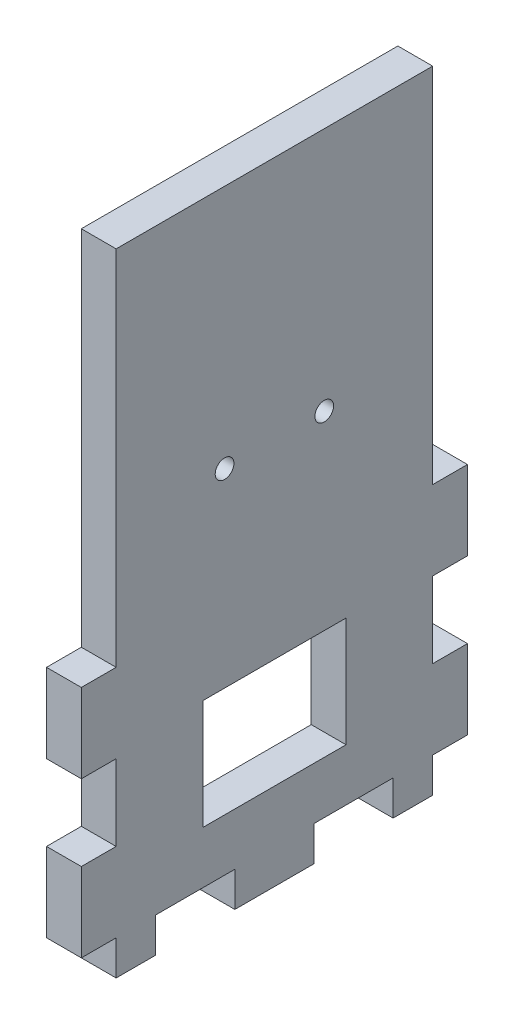
ISO-10303-21;
HEADER;
FILE_DESCRIPTION(('STEP AP214'),'2;1');
FILE_NAME('part.step','',(''),(''),'','','');
FILE_SCHEMA(('AUTOMOTIVE_DESIGN { 1 0 10303 214 1 1 1 1 }'));
ENDSEC;
DATA;
#1=APPLICATION_CONTEXT('core data for automotive mechanical design processes');
#2=APPLICATION_PROTOCOL_DEFINITION('international standard','automotive_design',2000,#1);
#3=PRODUCT_CONTEXT('',#1,'mechanical');
#4=PRODUCT('Part','Part','',(#3));
#5=PRODUCT_RELATED_PRODUCT_CATEGORY('part','',(#4));
#6=PRODUCT_DEFINITION_FORMATION('','',#4);
#7=PRODUCT_DEFINITION_CONTEXT('part definition',#1,'design');
#8=PRODUCT_DEFINITION('design','',#6,#7);
#9=PRODUCT_DEFINITION_SHAPE('','',#8);
#10=(LENGTH_UNIT() NAMED_UNIT(*) SI_UNIT(.MILLI.,.METRE.));
#11=(NAMED_UNIT(*) PLANE_ANGLE_UNIT() SI_UNIT($,.RADIAN.));
#12=(NAMED_UNIT(*) SI_UNIT($,.STERADIAN.) SOLID_ANGLE_UNIT());
#13=UNCERTAINTY_MEASURE_WITH_UNIT(LENGTH_MEASURE(1.E-05),#10,'distance_accuracy_value','');
#14=(GEOMETRIC_REPRESENTATION_CONTEXT(3) GLOBAL_UNCERTAINTY_ASSIGNED_CONTEXT((#13)) GLOBAL_UNIT_ASSIGNED_CONTEXT((#10,
#11,#12)) REPRESENTATION_CONTEXT('',''));
#15=CARTESIAN_POINT('',(0.,0.,0.));
#16=DIRECTION('',(0.,0.,1.));
#17=DIRECTION('',(1.,0.,0.));
#18=AXIS2_PLACEMENT_3D('',#15,#16,#17);
#19=CARTESIAN_POINT('',(136.525,5.588,-69.85));
#20=DIRECTION('',(-1.,0.,0.));
#21=DIRECTION('',(0.,0.,1.));
#22=AXIS2_PLACEMENT_3D('',#19,#20,#21);
#23=PLANE('',#22);
#24=CARTESIAN_POINT('',(136.525,62.088,8.));
#25=DIRECTION('',(1.,0.,0.));
#26=DIRECTION('',(0.,0.,-1.));
#27=AXIS2_PLACEMENT_3D('',#24,#25,#26);
#28=CIRCLE('',#27,1.5);
#29=CARTESIAN_POINT('',(136.525,62.088,6.5));
#30=VERTEX_POINT('',#29);
#31=EDGE_CURVE('E390',#30,#30,#28,.T.);
#32=ORIENTED_EDGE('',*,*,#31,.F.);
#33=EDGE_LOOP('',(#32));
#34=FACE_BOUND('',#33,.T.);
#35=CARTESIAN_POINT('',(136.525,62.088,-8.));
#36=DIRECTION('',(1.,0.,0.));
#37=DIRECTION('',(0.,0.,-1.));
#38=AXIS2_PLACEMENT_3D('',#35,#36,#37);
#39=CIRCLE('',#38,1.5);
#40=CARTESIAN_POINT('',(136.525,62.088,-9.50000000000001));
#41=VERTEX_POINT('',#40);
#42=EDGE_CURVE('E391',#41,#41,#39,.T.);
#43=ORIENTED_EDGE('',*,*,#42,.F.);
#44=EDGE_LOOP('',(#43));
#45=FACE_BOUND('',#44,.T.);
#46=DIRECTION('',(0.,0.,-1.));
#47=VECTOR('',#46,1.);
#48=CARTESIAN_POINT('',(136.525,13.97,11.5));
#49=LINE('',#48,#47);
#50=CARTESIAN_POINT('',(136.525,13.97,11.5));
#51=VERTEX_POINT('',#50);
#52=CARTESIAN_POINT('',(136.525,13.97,-11.5));
#53=VERTEX_POINT('',#52);
#54=EDGE_CURVE('E410',#51,#53,#49,.T.);
#55=ORIENTED_EDGE('',*,*,#54,.F.);
#56=DIRECTION('',(0.,-1.,0.));
#57=VECTOR('',#56,1.);
#58=CARTESIAN_POINT('',(136.525,31.58800007,11.5));
#59=LINE('',#58,#57);
#60=CARTESIAN_POINT('',(136.525,31.58800007,11.5));
#61=VERTEX_POINT('',#60);
#62=EDGE_CURVE('E57',#61,#51,#59,.T.);
#63=ORIENTED_EDGE('',*,*,#62,.F.);
#64=DIRECTION('',(0.,0.,1.));
#65=VECTOR('',#64,1.);
#66=CARTESIAN_POINT('',(136.525,31.58800007,11.5));
#67=LINE('',#66,#65);
#68=CARTESIAN_POINT('',(136.525,31.58800007,-11.5));
#69=VERTEX_POINT('',#68);
#70=EDGE_CURVE('E399',#69,#61,#67,.T.);
#71=ORIENTED_EDGE('',*,*,#70,.F.);
#72=DIRECTION('',(0.,1.,0.));
#73=VECTOR('',#72,1.);
#74=CARTESIAN_POINT('',(136.525,31.58800007,-11.5));
#75=LINE('',#74,#73);
#76=EDGE_CURVE('E413',#53,#69,#75,.T.);
#77=ORIENTED_EDGE('',*,*,#76,.F.);
#78=EDGE_LOOP('',(#55,#63,#71,#77));
#79=FACE_BOUND('',#78,.T.);
#80=DIRECTION('',(0.,-1.,0.));
#81=VECTOR('',#80,1.);
#82=CARTESIAN_POINT('',(136.525,0.,25.4));
#83=LINE('',#82,#81);
#84=CARTESIAN_POINT('',(136.525,5.588,25.4));
#85=VERTEX_POINT('',#84);
#86=CARTESIAN_POINT('',(136.525,0.,25.4));
#87=VERTEX_POINT('',#86);
#88=EDGE_CURVE('E269',#85,#87,#83,.T.);
#89=ORIENTED_EDGE('',*,*,#88,.T.);
#90=DIRECTION('',(0.,0.,-1.));
#91=VECTOR('',#90,1.);
#92=CARTESIAN_POINT('',(136.525,0.,-69.85));
#93=LINE('',#92,#91);
#94=CARTESIAN_POINT('',(136.525,0.,19.05));
#95=VERTEX_POINT('',#94);
#96=EDGE_CURVE('E472',#87,#95,#93,.T.);
#97=ORIENTED_EDGE('',*,*,#96,.T.);
#98=DIRECTION('',(0.,-1.,0.));
#99=VECTOR('',#98,1.);
#100=CARTESIAN_POINT('',(136.525,0.,19.05));
#101=LINE('',#100,#99);
#102=CARTESIAN_POINT('',(136.525,5.58799999999999,19.05));
#103=VERTEX_POINT('',#102);
#104=EDGE_CURVE('E437',#103,#95,#101,.T.);
#105=ORIENTED_EDGE('',*,*,#104,.F.);
#106=DIRECTION('',(0.,0.,-1.));
#107=VECTOR('',#106,1.);
#108=CARTESIAN_POINT('',(136.525,5.58799999999999,0.));
#109=LINE('',#108,#107);
#110=CARTESIAN_POINT('',(136.525,5.58799999999999,6.35));
#111=VERTEX_POINT('',#110);
#112=EDGE_CURVE('E430',#103,#111,#109,.T.);
#113=ORIENTED_EDGE('',*,*,#112,.T.);
#114=DIRECTION('',(0.,-1.,0.));
#115=VECTOR('',#114,1.);
#116=CARTESIAN_POINT('',(136.525,0.,6.35000000000001));
#117=LINE('',#116,#115);
#118=CARTESIAN_POINT('',(136.525,0.,6.35000000000001));
#119=VERTEX_POINT('',#118);
#120=EDGE_CURVE('E433',#111,#119,#117,.T.);
#121=ORIENTED_EDGE('',*,*,#120,.T.);
#122=CARTESIAN_POINT('',(136.525,0.,-6.34999999999999));
#123=VERTEX_POINT('',#122);
#124=EDGE_CURVE('E475',#119,#123,#93,.T.);
#125=ORIENTED_EDGE('',*,*,#124,.T.);
#126=DIRECTION('',(0.,-1.,0.));
#127=VECTOR('',#126,1.);
#128=CARTESIAN_POINT('',(136.525,0.,-6.34999999999999));
#129=LINE('',#128,#127);
#130=CARTESIAN_POINT('',(136.525,5.58799999999999,-6.35));
#131=VERTEX_POINT('',#130);
#132=EDGE_CURVE('E457',#131,#123,#129,.T.);
#133=ORIENTED_EDGE('',*,*,#132,.F.);
#134=DIRECTION('',(0.,0.,-1.));
#135=VECTOR('',#134,1.);
#136=CARTESIAN_POINT('',(136.525,5.58799999999999,0.));
#137=LINE('',#136,#135);
#138=CARTESIAN_POINT('',(136.525,5.58799999999999,-19.05));
#139=VERTEX_POINT('',#138);
#140=EDGE_CURVE('E427',#131,#139,#137,.T.);
#141=ORIENTED_EDGE('',*,*,#140,.T.);
#142=DIRECTION('',(0.,-1.,0.));
#143=VECTOR('',#142,1.);
#144=CARTESIAN_POINT('',(136.525,0.,-19.05));
#145=LINE('',#144,#143);
#146=CARTESIAN_POINT('',(136.525,0.,-19.05));
#147=VERTEX_POINT('',#146);
#148=EDGE_CURVE('E454',#139,#147,#145,.T.);
#149=ORIENTED_EDGE('',*,*,#148,.T.);
#150=CARTESIAN_POINT('',(136.525,0.,-25.4));
#151=VERTEX_POINT('',#150);
#152=EDGE_CURVE('E470',#147,#151,#93,.T.);
#153=ORIENTED_EDGE('',*,*,#152,.T.);
#154=DIRECTION('',(0.,-1.,0.));
#155=VECTOR('',#154,1.);
#156=CARTESIAN_POINT('',(136.525,0.,-25.4));
#157=LINE('',#156,#155);
#158=CARTESIAN_POINT('',(136.525,5.588,-25.4));
#159=VERTEX_POINT('',#158);
#160=EDGE_CURVE('E322',#159,#151,#157,.T.);
#161=ORIENTED_EDGE('',*,*,#160,.F.);
#162=DIRECTION('',(0.,0.,-1.));
#163=VECTOR('',#162,1.);
#164=CARTESIAN_POINT('',(136.525,5.588,0.));
#165=LINE('',#164,#163);
#166=CARTESIAN_POINT('',(136.525,5.588,-30.988));
#167=VERTEX_POINT('',#166);
#168=EDGE_CURVE('E338',#159,#167,#165,.T.);
#169=ORIENTED_EDGE('',*,*,#168,.T.);
#170=DIRECTION('',(0.,-1.,0.));
#171=VECTOR('',#170,1.);
#172=CARTESIAN_POINT('',(136.525,0.,-30.988));
#173=LINE('',#172,#171);
#174=CARTESIAN_POINT('',(136.525,18.288,-30.988));
#175=VERTEX_POINT('',#174);
#176=EDGE_CURVE('E335',#175,#167,#173,.T.);
#177=ORIENTED_EDGE('',*,*,#176,.F.);
#178=DIRECTION('',(0.,0.,-1.));
#179=VECTOR('',#178,1.);
#180=CARTESIAN_POINT('',(136.525,18.288,0.));
#181=LINE('',#180,#179);
#182=CARTESIAN_POINT('',(136.525,18.288,-25.4));
#183=VERTEX_POINT('',#182);
#184=EDGE_CURVE('E332',#183,#175,#181,.T.);
#185=ORIENTED_EDGE('',*,*,#184,.F.);
#186=CARTESIAN_POINT('',(136.525,30.48,-25.4));
#187=VERTEX_POINT('',#186);
#188=EDGE_CURVE('E323',#187,#183,#157,.T.);
#189=ORIENTED_EDGE('',*,*,#188,.F.);
#190=DIRECTION('',(0.,0.,-1.));
#191=VECTOR('',#190,1.);
#192=CARTESIAN_POINT('',(136.525,30.48,0.));
#193=LINE('',#192,#191);
#194=CARTESIAN_POINT('',(136.525,30.48,-30.988));
#195=VERTEX_POINT('',#194);
#196=EDGE_CURVE('E329',#187,#195,#193,.T.);
#197=ORIENTED_EDGE('',*,*,#196,.T.);
#198=DIRECTION('',(0.,-1.,0.));
#199=VECTOR('',#198,1.);
#200=CARTESIAN_POINT('',(136.525,0.,-30.988));
#201=LINE('',#200,#199);
#202=CARTESIAN_POINT('',(136.525,43.18,-30.988));
#203=VERTEX_POINT('',#202);
#204=EDGE_CURVE('E326',#203,#195,#201,.T.);
#205=ORIENTED_EDGE('',*,*,#204,.F.);
#206=DIRECTION('',(0.,0.,-1.));
#207=VECTOR('',#206,1.);
#208=CARTESIAN_POINT('',(136.525,43.18,0.));
#209=LINE('',#208,#207);
#210=CARTESIAN_POINT('',(136.525,43.18,-25.4));
#211=VERTEX_POINT('',#210);
#212=EDGE_CURVE('E321',#211,#203,#209,.T.);
#213=ORIENTED_EDGE('',*,*,#212,.F.);
#214=CARTESIAN_POINT('',(136.525,101.346,-25.4));
#215=VERTEX_POINT('',#214);
#216=EDGE_CURVE('E318',#215,#211,#157,.T.);
#217=ORIENTED_EDGE('',*,*,#216,.F.);
#218=DIRECTION('',(0.,0.,-1.));
#219=VECTOR('',#218,1.);
#220=CARTESIAN_POINT('',(136.525,101.346,0.));
#221=LINE('',#220,#219);
#222=CARTESIAN_POINT('',(136.525,101.346,25.4));
#223=VERTEX_POINT('',#222);
#224=EDGE_CURVE('E315',#223,#215,#221,.T.);
#225=ORIENTED_EDGE('',*,*,#224,.F.);
#226=CARTESIAN_POINT('',(136.525,43.18,25.4));
#227=VERTEX_POINT('',#226);
#228=EDGE_CURVE('E270',#223,#227,#83,.T.);
#229=ORIENTED_EDGE('',*,*,#228,.T.);
#230=DIRECTION('',(0.,0.,1.));
#231=VECTOR('',#230,1.);
#232=CARTESIAN_POINT('',(136.525,43.18,0.));
#233=LINE('',#232,#231);
#234=CARTESIAN_POINT('',(136.525,43.18,30.988));
#235=VERTEX_POINT('',#234);
#236=EDGE_CURVE('E311',#227,#235,#233,.T.);
#237=ORIENTED_EDGE('',*,*,#236,.T.);
#238=DIRECTION('',(0.,1.,0.));
#239=VECTOR('',#238,1.);
#240=CARTESIAN_POINT('',(136.525,0.,30.988));
#241=LINE('',#240,#239);
#242=CARTESIAN_POINT('',(136.525,30.48,30.988));
#243=VERTEX_POINT('',#242);
#244=EDGE_CURVE('E309',#243,#235,#241,.T.);
#245=ORIENTED_EDGE('',*,*,#244,.F.);
#246=DIRECTION('',(0.,0.,1.));
#247=VECTOR('',#246,1.);
#248=CARTESIAN_POINT('',(136.525,30.48,0.));
#249=LINE('',#248,#247);
#250=CARTESIAN_POINT('',(136.525,30.48,25.4));
#251=VERTEX_POINT('',#250);
#252=EDGE_CURVE('E250',#251,#243,#249,.T.);
#253=ORIENTED_EDGE('',*,*,#252,.F.);
#254=CARTESIAN_POINT('',(136.525,18.288,25.4));
#255=VERTEX_POINT('',#254);
#256=EDGE_CURVE('E264',#251,#255,#83,.T.);
#257=ORIENTED_EDGE('',*,*,#256,.T.);
#258=DIRECTION('',(0.,0.,1.));
#259=VECTOR('',#258,1.);
#260=CARTESIAN_POINT('',(136.525,18.288,0.));
#261=LINE('',#260,#259);
#262=CARTESIAN_POINT('',(136.525,18.288,30.988));
#263=VERTEX_POINT('',#262);
#264=EDGE_CURVE('E267',#255,#263,#261,.T.);
#265=ORIENTED_EDGE('',*,*,#264,.T.);
#266=DIRECTION('',(0.,1.,0.));
#267=VECTOR('',#266,1.);
#268=CARTESIAN_POINT('',(136.525,0.,30.988));
#269=LINE('',#268,#267);
#270=CARTESIAN_POINT('',(136.525,5.588,30.988));
#271=VERTEX_POINT('',#270);
#272=EDGE_CURVE('E344',#271,#263,#269,.T.);
#273=ORIENTED_EDGE('',*,*,#272,.F.);
#274=DIRECTION('',(0.,0.,1.));
#275=VECTOR('',#274,1.);
#276=CARTESIAN_POINT('',(136.525,5.58800000000003,0.));
#277=LINE('',#276,#275);
#278=EDGE_CURVE('E341',#85,#271,#277,.T.);
#279=ORIENTED_EDGE('',*,*,#278,.F.);
#280=EDGE_LOOP('',(#89,#97,#105,#113,#121,#125,#133,#141,#149,#153,#161,#169,#177,#185,#189,
#197,#205,#213,#217,#225,#229,#237,#245,#253,#257,#265,#273,#279));
#281=FACE_BOUND('',#280,.T.);
#282=ADVANCED_FACE('F35',(#34,#45,#79,#281),#23,.F.);
#283=CARTESIAN_POINT('',(0.,0.,0.));
#284=DIRECTION('',(0.,1.,0.));
#285=DIRECTION('',(0.,0.,1.));
#286=AXIS2_PLACEMENT_3D('',#283,#284,#285);
#287=PLANE('',#286);
#288=DIRECTION('',(1.,0.,0.));
#289=VECTOR('',#288,1.);
#290=CARTESIAN_POINT('',(130.937,0.,25.4));
#291=LINE('',#290,#289);
#292=CARTESIAN_POINT('',(130.937,0.,25.4));
#293=VERTEX_POINT('',#292);
#294=EDGE_CURVE('E359',#293,#87,#291,.T.);
#295=ORIENTED_EDGE('',*,*,#294,.F.);
#296=DIRECTION('',(0.,0.,-1.));
#297=VECTOR('',#296,1.);
#298=CARTESIAN_POINT('',(130.937,0.,0.));
#299=LINE('',#298,#297);
#300=CARTESIAN_POINT('',(130.937,0.,19.05));
#301=VERTEX_POINT('',#300);
#302=EDGE_CURVE('E468',#293,#301,#299,.T.);
#303=ORIENTED_EDGE('',*,*,#302,.T.);
#304=DIRECTION('',(-1.,0.,0.));
#305=VECTOR('',#304,1.);
#306=CARTESIAN_POINT('',(136.525,0.,19.05));
#307=LINE('',#306,#305);
#308=EDGE_CURVE('E445',#95,#301,#307,.T.);
#309=ORIENTED_EDGE('',*,*,#308,.F.);
#310=ORIENTED_EDGE('',*,*,#96,.F.);
#311=EDGE_LOOP('',(#295,#303,#309,#310));
#312=FACE_BOUND('',#311,.T.);
#313=ADVANCED_FACE('F528',(#312),#287,.F.);
#314=CARTESIAN_POINT('',(130.937,304.038,-64.262));
#315=DIRECTION('',(-1.,0.,0.));
#316=DIRECTION('',(0.,0.,1.));
#317=AXIS2_PLACEMENT_3D('',#314,#315,#316);
#318=PLANE('',#317);
#319=CARTESIAN_POINT('',(130.937,62.088,8.));
#320=DIRECTION('',(1.,0.,0.));
#321=DIRECTION('',(0.,0.,-1.));
#322=AXIS2_PLACEMENT_3D('',#319,#320,#321);
#323=CIRCLE('',#322,1.5);
#324=CARTESIAN_POINT('',(130.937,62.088,6.5));
#325=VERTEX_POINT('',#324);
#326=EDGE_CURVE('E424',#325,#325,#323,.T.);
#327=ORIENTED_EDGE('',*,*,#326,.T.);
#328=EDGE_LOOP('',(#327));
#329=FACE_BOUND('',#328,.T.);
#330=CARTESIAN_POINT('',(130.937,62.088,-8.));
#331=DIRECTION('',(1.,0.,0.));
#332=DIRECTION('',(0.,0.,-1.));
#333=AXIS2_PLACEMENT_3D('',#330,#331,#332);
#334=CIRCLE('',#333,1.5);
#335=CARTESIAN_POINT('',(130.937,62.088,-9.50000000000001));
#336=VERTEX_POINT('',#335);
#337=EDGE_CURVE('E387',#336,#336,#334,.T.);
#338=ORIENTED_EDGE('',*,*,#337,.T.);
#339=EDGE_LOOP('',(#338));
#340=FACE_BOUND('',#339,.T.);
#341=DIRECTION('',(0.,-1.,0.));
#342=VECTOR('',#341,1.);
#343=CARTESIAN_POINT('',(130.937,31.58800007,11.5));
#344=LINE('',#343,#342);
#345=CARTESIAN_POINT('',(130.937,31.58800007,11.5));
#346=VERTEX_POINT('',#345);
#347=CARTESIAN_POINT('',(130.937,13.97,11.5));
#348=VERTEX_POINT('',#347);
#349=EDGE_CURVE('E395',#346,#348,#344,.T.);
#350=ORIENTED_EDGE('',*,*,#349,.T.);
#351=DIRECTION('',(0.,0.,-1.));
#352=VECTOR('',#351,1.);
#353=CARTESIAN_POINT('',(130.937,13.97,11.5));
#354=LINE('',#353,#352);
#355=CARTESIAN_POINT('',(130.937,13.97,-11.5));
#356=VERTEX_POINT('',#355);
#357=EDGE_CURVE('E398',#348,#356,#354,.T.);
#358=ORIENTED_EDGE('',*,*,#357,.T.);
#359=DIRECTION('',(0.,1.,0.));
#360=VECTOR('',#359,1.);
#361=CARTESIAN_POINT('',(130.937,31.58800007,-11.5));
#362=LINE('',#361,#360);
#363=CARTESIAN_POINT('',(130.937,31.58800007,-11.5));
#364=VERTEX_POINT('',#363);
#365=EDGE_CURVE('E402',#356,#364,#362,.T.);
#366=ORIENTED_EDGE('',*,*,#365,.T.);
#367=DIRECTION('',(0.,0.,1.));
#368=VECTOR('',#367,1.);
#369=CARTESIAN_POINT('',(130.937,31.58800007,11.5));
#370=LINE('',#369,#368);
#371=EDGE_CURVE('E405',#364,#346,#370,.T.);
#372=ORIENTED_EDGE('',*,*,#371,.T.);
#373=EDGE_LOOP('',(#350,#358,#366,#372));
#374=FACE_BOUND('',#373,.T.);
#375=ORIENTED_EDGE('',*,*,#302,.F.);
#376=DIRECTION('',(0.,-1.,0.));
#377=VECTOR('',#376,1.);
#378=CARTESIAN_POINT('',(130.937,0.,25.4));
#379=LINE('',#378,#377);
#380=CARTESIAN_POINT('',(130.937,5.588,25.4));
#381=VERTEX_POINT('',#380);
#382=EDGE_CURVE('E276',#381,#293,#379,.T.);
#383=ORIENTED_EDGE('',*,*,#382,.F.);
#384=DIRECTION('',(0.,0.,1.));
#385=VECTOR('',#384,1.);
#386=CARTESIAN_POINT('',(130.937,5.58800000000003,0.));
#387=LINE('',#386,#385);
#388=CARTESIAN_POINT('',(130.937,5.588,30.988));
#389=VERTEX_POINT('',#388);
#390=EDGE_CURVE('E300',#381,#389,#387,.T.);
#391=ORIENTED_EDGE('',*,*,#390,.T.);
#392=DIRECTION('',(0.,1.,0.));
#393=VECTOR('',#392,1.);
#394=CARTESIAN_POINT('',(130.937,0.,30.988));
#395=LINE('',#394,#393);
#396=CARTESIAN_POINT('',(130.937,18.288,30.988));
#397=VERTEX_POINT('',#396);
#398=EDGE_CURVE('E303',#389,#397,#395,.T.);
#399=ORIENTED_EDGE('',*,*,#398,.T.);
#400=DIRECTION('',(0.,0.,1.));
#401=VECTOR('',#400,1.);
#402=CARTESIAN_POINT('',(130.937,18.288,0.));
#403=LINE('',#402,#401);
#404=CARTESIAN_POINT('',(130.937,18.288,25.4));
#405=VERTEX_POINT('',#404);
#406=EDGE_CURVE('E306',#405,#397,#403,.T.);
#407=ORIENTED_EDGE('',*,*,#406,.F.);
#408=CARTESIAN_POINT('',(130.937,30.48,25.4));
#409=VERTEX_POINT('',#408);
#410=EDGE_CURVE('E252',#409,#405,#379,.T.);
#411=ORIENTED_EDGE('',*,*,#410,.F.);
#412=DIRECTION('',(0.,0.,1.));
#413=VECTOR('',#412,1.);
#414=CARTESIAN_POINT('',(130.937,30.48,0.));
#415=LINE('',#414,#413);
#416=CARTESIAN_POINT('',(130.937,30.48,30.988));
#417=VERTEX_POINT('',#416);
#418=EDGE_CURVE('E247',#409,#417,#415,.T.);
#419=ORIENTED_EDGE('',*,*,#418,.T.);
#420=DIRECTION('',(0.,1.,0.));
#421=VECTOR('',#420,1.);
#422=CARTESIAN_POINT('',(130.937,0.,30.988));
#423=LINE('',#422,#421);
#424=CARTESIAN_POINT('',(130.937,43.18,30.988));
#425=VERTEX_POINT('',#424);
#426=EDGE_CURVE('E255',#417,#425,#423,.T.);
#427=ORIENTED_EDGE('',*,*,#426,.T.);
#428=DIRECTION('',(0.,0.,1.));
#429=VECTOR('',#428,1.);
#430=CARTESIAN_POINT('',(130.937,43.18,0.));
#431=LINE('',#430,#429);
#432=CARTESIAN_POINT('',(130.937,43.18,25.4));
#433=VERTEX_POINT('',#432);
#434=EDGE_CURVE('E259',#433,#425,#431,.T.);
#435=ORIENTED_EDGE('',*,*,#434,.F.);
#436=CARTESIAN_POINT('',(130.937,101.346,25.4));
#437=VERTEX_POINT('',#436);
#438=EDGE_CURVE('E273',#437,#433,#379,.T.);
#439=ORIENTED_EDGE('',*,*,#438,.F.);
#440=DIRECTION('',(0.,0.,-1.));
#441=VECTOR('',#440,1.);
#442=CARTESIAN_POINT('',(130.937,101.346,0.));
#443=LINE('',#442,#441);
#444=CARTESIAN_POINT('',(130.937,101.346,-25.4));
#445=VERTEX_POINT('',#444);
#446=EDGE_CURVE('E275',#437,#445,#443,.T.);
#447=ORIENTED_EDGE('',*,*,#446,.T.);
#448=DIRECTION('',(0.,-1.,0.));
#449=VECTOR('',#448,1.);
#450=CARTESIAN_POINT('',(130.937,0.,-25.4));
#451=LINE('',#450,#449);
#452=CARTESIAN_POINT('',(130.937,43.18,-25.4));
#453=VERTEX_POINT('',#452);
#454=EDGE_CURVE('E279',#445,#453,#451,.T.);
#455=ORIENTED_EDGE('',*,*,#454,.T.);
#456=DIRECTION('',(0.,0.,-1.));
#457=VECTOR('',#456,1.);
#458=CARTESIAN_POINT('',(130.937,43.18,0.));
#459=LINE('',#458,#457);
#460=CARTESIAN_POINT('',(130.937,43.18,-30.988));
#461=VERTEX_POINT('',#460);
#462=EDGE_CURVE('E282',#453,#461,#459,.T.);
#463=ORIENTED_EDGE('',*,*,#462,.T.);
#464=DIRECTION('',(0.,-1.,0.));
#465=VECTOR('',#464,1.);
#466=CARTESIAN_POINT('',(130.937,0.,-30.988));
#467=LINE('',#466,#465);
#468=CARTESIAN_POINT('',(130.937,30.48,-30.988));
#469=VERTEX_POINT('',#468);
#470=EDGE_CURVE('E287',#461,#469,#467,.T.);
#471=ORIENTED_EDGE('',*,*,#470,.T.);
#472=DIRECTION('',(0.,0.,-1.));
#473=VECTOR('',#472,1.);
#474=CARTESIAN_POINT('',(130.937,30.48,0.));
#475=LINE('',#474,#473);
#476=CARTESIAN_POINT('',(130.937,30.48,-25.4));
#477=VERTEX_POINT('',#476);
#478=EDGE_CURVE('E290',#477,#469,#475,.T.);
#479=ORIENTED_EDGE('',*,*,#478,.F.);
#480=CARTESIAN_POINT('',(130.937,18.288,-25.4));
#481=VERTEX_POINT('',#480);
#482=EDGE_CURVE('E284',#477,#481,#451,.T.);
#483=ORIENTED_EDGE('',*,*,#482,.T.);
#484=DIRECTION('',(0.,0.,-1.));
#485=VECTOR('',#484,1.);
#486=CARTESIAN_POINT('',(130.937,18.288,0.));
#487=LINE('',#486,#485);
#488=CARTESIAN_POINT('',(130.937,18.288,-30.988));
#489=VERTEX_POINT('',#488);
#490=EDGE_CURVE('E292',#481,#489,#487,.T.);
#491=ORIENTED_EDGE('',*,*,#490,.T.);
#492=DIRECTION('',(0.,-1.,0.));
#493=VECTOR('',#492,1.);
#494=CARTESIAN_POINT('',(130.937,0.,-30.988));
#495=LINE('',#494,#493);
#496=CARTESIAN_POINT('',(130.937,5.588,-30.988));
#497=VERTEX_POINT('',#496);
#498=EDGE_CURVE('E295',#489,#497,#495,.T.);
#499=ORIENTED_EDGE('',*,*,#498,.T.);
#500=DIRECTION('',(0.,0.,-1.));
#501=VECTOR('',#500,1.);
#502=CARTESIAN_POINT('',(130.937,5.588,0.));
#503=LINE('',#502,#501);
#504=CARTESIAN_POINT('',(130.937,5.588,-25.4));
#505=VERTEX_POINT('',#504);
#506=EDGE_CURVE('E298',#505,#497,#503,.T.);
#507=ORIENTED_EDGE('',*,*,#506,.F.);
#508=CARTESIAN_POINT('',(130.937,0.,-25.4));
#509=VERTEX_POINT('',#508);
#510=EDGE_CURVE('E283',#505,#509,#451,.T.);
#511=ORIENTED_EDGE('',*,*,#510,.T.);
#512=CARTESIAN_POINT('',(130.937,0.,-19.05));
#513=VERTEX_POINT('',#512);
#514=EDGE_CURVE('E444',#513,#509,#299,.T.);
#515=ORIENTED_EDGE('',*,*,#514,.F.);
#516=DIRECTION('',(0.,-1.,0.));
#517=VECTOR('',#516,1.);
#518=CARTESIAN_POINT('',(130.937,304.038,-19.05));
#519=LINE('',#518,#517);
#520=CARTESIAN_POINT('',(130.937,5.58800000000004,-19.05));
#521=VERTEX_POINT('',#520);
#522=EDGE_CURVE('E483',#521,#513,#519,.T.);
#523=ORIENTED_EDGE('',*,*,#522,.F.);
#524=DIRECTION('',(0.,0.,-1.));
#525=VECTOR('',#524,1.);
#526=CARTESIAN_POINT('',(130.937,5.58799999999998,-64.262));
#527=LINE('',#526,#525);
#528=CARTESIAN_POINT('',(130.937,5.58799999999999,-6.35));
#529=VERTEX_POINT('',#528);
#530=EDGE_CURVE('E42',#529,#521,#527,.T.);
#531=ORIENTED_EDGE('',*,*,#530,.F.);
#532=DIRECTION('',(0.,-1.,0.));
#533=VECTOR('',#532,1.);
#534=CARTESIAN_POINT('',(130.937,304.038,-6.35000000000004));
#535=LINE('',#534,#533);
#536=CARTESIAN_POINT('',(130.937,0.,-6.34999999999999));
#537=VERTEX_POINT('',#536);
#538=EDGE_CURVE('E11',#529,#537,#535,.T.);
#539=ORIENTED_EDGE('',*,*,#538,.T.);
#540=CARTESIAN_POINT('',(130.937,0.,6.35000000000001));
#541=VERTEX_POINT('',#540);
#542=EDGE_CURVE('E471',#541,#537,#299,.T.);
#543=ORIENTED_EDGE('',*,*,#542,.F.);
#544=DIRECTION('',(0.,-1.,0.));
#545=VECTOR('',#544,1.);
#546=CARTESIAN_POINT('',(130.937,304.038,6.3499999999993));
#547=LINE('',#546,#545);
#548=CARTESIAN_POINT('',(130.937,5.58800000000004,6.35));
#549=VERTEX_POINT('',#548);
#550=EDGE_CURVE('E474',#549,#541,#547,.T.);
#551=ORIENTED_EDGE('',*,*,#550,.F.);
#552=DIRECTION('',(0.,0.,-1.));
#553=VECTOR('',#552,1.);
#554=CARTESIAN_POINT('',(130.937,5.58799999999998,-64.2620000000001));
#555=LINE('',#554,#553);
#556=CARTESIAN_POINT('',(130.937,5.58799999999999,19.05));
#557=VERTEX_POINT('',#556);
#558=EDGE_CURVE('E477',#557,#549,#555,.T.);
#559=ORIENTED_EDGE('',*,*,#558,.F.);
#560=DIRECTION('',(0.,-1.,0.));
#561=VECTOR('',#560,1.);
#562=CARTESIAN_POINT('',(130.937,304.038,19.05));
#563=LINE('',#562,#561);
#564=EDGE_CURVE('E480',#557,#301,#563,.T.);
#565=ORIENTED_EDGE('',*,*,#564,.T.);
#566=EDGE_LOOP('',(#375,#383,#391,#399,#407,#411,#419,#427,#435,#439,#447,#455,#463,#471,#479,
#483,#491,#499,#507,#511,#515,#523,#531,#539,#543,#551,#559,#565));
#567=FACE_BOUND('',#566,.T.);
#568=ADVANCED_FACE('F262',(#329,#340,#374,#567),#318,.T.);
#569=ORIENTED_EDGE('',*,*,#514,.T.);
#570=DIRECTION('',(1.,0.,0.));
#571=VECTOR('',#570,1.);
#572=CARTESIAN_POINT('',(130.937,0.,-25.4));
#573=LINE('',#572,#571);
#574=EDGE_CURVE('E361',#509,#151,#573,.T.);
#575=ORIENTED_EDGE('',*,*,#574,.T.);
#576=ORIENTED_EDGE('',*,*,#152,.F.);
#577=DIRECTION('',(-1.,0.,0.));
#578=VECTOR('',#577,1.);
#579=CARTESIAN_POINT('',(136.525,0.,-19.05));
#580=LINE('',#579,#578);
#581=EDGE_CURVE('E464',#147,#513,#580,.T.);
#582=ORIENTED_EDGE('',*,*,#581,.T.);
#583=EDGE_LOOP('',(#569,#575,#576,#582));
#584=FACE_BOUND('',#583,.T.);
#585=ADVANCED_FACE('F498',(#584),#287,.F.);
#586=DIRECTION('',(-1.,0.,0.));
#587=VECTOR('',#586,1.);
#588=CARTESIAN_POINT('',(136.525,0.,-6.34999999999999));
#589=LINE('',#588,#587);
#590=EDGE_CURVE('E462',#123,#537,#589,.T.);
#591=ORIENTED_EDGE('',*,*,#590,.F.);
#592=ORIENTED_EDGE('',*,*,#124,.F.);
#593=DIRECTION('',(-1.,0.,0.));
#594=VECTOR('',#593,1.);
#595=CARTESIAN_POINT('',(136.525,0.,6.35000000000001));
#596=LINE('',#595,#594);
#597=EDGE_CURVE('E448',#119,#541,#596,.T.);
#598=ORIENTED_EDGE('',*,*,#597,.T.);
#599=ORIENTED_EDGE('',*,*,#542,.T.);
#600=EDGE_LOOP('',(#591,#592,#598,#599));
#601=FACE_BOUND('',#600,.T.);
#602=ADVANCED_FACE('F509',(#601),#287,.F.);
#603=CARTESIAN_POINT('',(136.525,5.58799999999999,0.));
#604=DIRECTION('',(0.,1.,0.));
#605=DIRECTION('',(0.,0.,1.));
#606=AXIS2_PLACEMENT_3D('',#603,#604,#605);
#607=PLANE('',#606);
#608=ORIENTED_EDGE('',*,*,#558,.T.);
#609=DIRECTION('',(-1.,0.,0.));
#610=VECTOR('',#609,1.);
#611=CARTESIAN_POINT('',(136.525,5.58799999999999,6.35));
#612=LINE('',#611,#610);
#613=EDGE_CURVE('E440',#111,#549,#612,.T.);
#614=ORIENTED_EDGE('',*,*,#613,.F.);
#615=ORIENTED_EDGE('',*,*,#112,.F.);
#616=DIRECTION('',(-1.,0.,0.));
#617=VECTOR('',#616,1.);
#618=CARTESIAN_POINT('',(136.525,5.58799999999999,19.05));
#619=LINE('',#618,#617);
#620=EDGE_CURVE('E441',#103,#557,#619,.T.);
#621=ORIENTED_EDGE('',*,*,#620,.T.);
#622=EDGE_LOOP('',(#608,#614,#615,#621));
#623=FACE_BOUND('',#622,.T.);
#624=ADVANCED_FACE('F520',(#623),#607,.F.);
#625=CARTESIAN_POINT('',(136.525,0.,19.05));
#626=DIRECTION('',(0.,0.,-1.));
#627=DIRECTION('',(-1.,0.,0.));
#628=AXIS2_PLACEMENT_3D('',#625,#626,#627);
#629=PLANE('',#628);
#630=ORIENTED_EDGE('',*,*,#620,.F.);
#631=ORIENTED_EDGE('',*,*,#104,.T.);
#632=ORIENTED_EDGE('',*,*,#308,.T.);
#633=ORIENTED_EDGE('',*,*,#564,.F.);
#634=EDGE_LOOP('',(#630,#631,#632,#633));
#635=FACE_BOUND('',#634,.T.);
#636=ADVANCED_FACE('F523',(#635),#629,.T.);
#637=CARTESIAN_POINT('',(136.525,0.,6.35000000000001));
#638=DIRECTION('',(0.,0.,-1.));
#639=DIRECTION('',(0.,1.,0.));
#640=AXIS2_PLACEMENT_3D('',#637,#638,#639);
#641=PLANE('',#640);
#642=ORIENTED_EDGE('',*,*,#550,.T.);
#643=ORIENTED_EDGE('',*,*,#597,.F.);
#644=ORIENTED_EDGE('',*,*,#120,.F.);
#645=ORIENTED_EDGE('',*,*,#613,.T.);
#646=EDGE_LOOP('',(#642,#643,#644,#645));
#647=FACE_BOUND('',#646,.T.);
#648=ADVANCED_FACE('F517',(#647),#641,.F.);
#649=CARTESIAN_POINT('',(136.525,5.58799999999999,0.));
#650=DIRECTION('',(0.,1.,0.));
#651=DIRECTION('',(0.,0.,1.));
#652=AXIS2_PLACEMENT_3D('',#649,#650,#651);
#653=PLANE('',#652);
#654=ORIENTED_EDGE('',*,*,#530,.T.);
#655=DIRECTION('',(-1.,0.,0.));
#656=VECTOR('',#655,1.);
#657=CARTESIAN_POINT('',(136.525,5.58799999999999,-19.05));
#658=LINE('',#657,#656);
#659=EDGE_CURVE('E459',#139,#521,#658,.T.);
#660=ORIENTED_EDGE('',*,*,#659,.F.);
#661=ORIENTED_EDGE('',*,*,#140,.F.);
#662=DIRECTION('',(-1.,0.,0.));
#663=VECTOR('',#662,1.);
#664=CARTESIAN_POINT('',(136.525,5.58799999999999,-6.35));
#665=LINE('',#664,#663);
#666=EDGE_CURVE('E434',#131,#529,#665,.T.);
#667=ORIENTED_EDGE('',*,*,#666,.T.);
#668=EDGE_LOOP('',(#654,#660,#661,#667));
#669=FACE_BOUND('',#668,.T.);
#670=ADVANCED_FACE('F488',(#669),#653,.F.);
#671=CARTESIAN_POINT('',(136.525,0.,-6.34999999999999));
#672=DIRECTION('',(0.,0.,-1.));
#673=DIRECTION('',(0.,1.,0.));
#674=AXIS2_PLACEMENT_3D('',#671,#672,#673);
#675=PLANE('',#674);
#676=ORIENTED_EDGE('',*,*,#666,.F.);
#677=ORIENTED_EDGE('',*,*,#132,.T.);
#678=ORIENTED_EDGE('',*,*,#590,.T.);
#679=ORIENTED_EDGE('',*,*,#538,.F.);
#680=EDGE_LOOP('',(#676,#677,#678,#679));
#681=FACE_BOUND('',#680,.T.);
#682=ADVANCED_FACE('F513',(#681),#675,.T.);
#683=CARTESIAN_POINT('',(136.525,0.,-19.05));
#684=DIRECTION('',(0.,0.,-1.));
#685=DIRECTION('',(-1.,0.,0.));
#686=AXIS2_PLACEMENT_3D('',#683,#684,#685);
#687=PLANE('',#686);
#688=ORIENTED_EDGE('',*,*,#522,.T.);
#689=ORIENTED_EDGE('',*,*,#581,.F.);
#690=ORIENTED_EDGE('',*,*,#148,.F.);
#691=ORIENTED_EDGE('',*,*,#659,.T.);
#692=EDGE_LOOP('',(#688,#689,#690,#691));
#693=FACE_BOUND('',#692,.T.);
#694=ADVANCED_FACE('F495',(#693),#687,.F.);
#695=CARTESIAN_POINT('',(130.937,62.088,8.));
#696=DIRECTION('',(1.,0.,0.));
#697=DIRECTION('',(0.,0.,-1.));
#698=AXIS2_PLACEMENT_3D('',#695,#696,#697);
#699=CYLINDRICAL_SURFACE('',#698,1.5);
#700=ORIENTED_EDGE('',*,*,#326,.F.);
#701=EDGE_LOOP('',(#700));
#702=FACE_BOUND('',#701,.T.);
#703=ORIENTED_EDGE('',*,*,#31,.T.);
#704=EDGE_LOOP('',(#703));
#705=FACE_BOUND('',#704,.T.);
#706=ADVANCED_FACE('F638',(#702,#705),#699,.F.);
#707=CARTESIAN_POINT('',(130.937,62.088,-8.));
#708=DIRECTION('',(1.,0.,0.));
#709=DIRECTION('',(0.,0.,-1.));
#710=AXIS2_PLACEMENT_3D('',#707,#708,#709);
#711=CYLINDRICAL_SURFACE('',#710,1.5);
#712=ORIENTED_EDGE('',*,*,#337,.F.);
#713=EDGE_LOOP('',(#712));
#714=FACE_BOUND('',#713,.T.);
#715=ORIENTED_EDGE('',*,*,#42,.T.);
#716=EDGE_LOOP('',(#715));
#717=FACE_BOUND('',#716,.T.);
#718=ADVANCED_FACE('F637',(#714,#717),#711,.F.);
#719=CARTESIAN_POINT('',(130.937,31.58800007,11.5));
#720=DIRECTION('',(0.,0.,1.));
#721=DIRECTION('',(0.,-1.,0.));
#722=AXIS2_PLACEMENT_3D('',#719,#720,#721);
#723=PLANE('',#722);
#724=ORIENTED_EDGE('',*,*,#62,.T.);
#725=DIRECTION('',(1.,0.,0.));
#726=VECTOR('',#725,1.);
#727=CARTESIAN_POINT('',(130.937,13.97,11.5));
#728=LINE('',#727,#726);
#729=EDGE_CURVE('E408',#348,#51,#728,.T.);
#730=ORIENTED_EDGE('',*,*,#729,.F.);
#731=ORIENTED_EDGE('',*,*,#349,.F.);
#732=DIRECTION('',(1.,0.,0.));
#733=VECTOR('',#732,1.);
#734=CARTESIAN_POINT('',(130.937,31.58800007,11.5));
#735=LINE('',#734,#733);
#736=EDGE_CURVE('E394',#346,#61,#735,.T.);
#737=ORIENTED_EDGE('',*,*,#736,.T.);
#738=EDGE_LOOP('',(#724,#730,#731,#737));
#739=FACE_BOUND('',#738,.T.);
#740=ADVANCED_FACE('F618',(#739),#723,.F.);
#741=CARTESIAN_POINT('',(130.937,31.58800007,11.5));
#742=DIRECTION('',(0.,1.,0.));
#743=DIRECTION('',(0.,0.,1.));
#744=AXIS2_PLACEMENT_3D('',#741,#742,#743);
#745=PLANE('',#744);
#746=ORIENTED_EDGE('',*,*,#70,.T.);
#747=ORIENTED_EDGE('',*,*,#736,.F.);
#748=ORIENTED_EDGE('',*,*,#371,.F.);
#749=DIRECTION('',(1.,0.,0.));
#750=VECTOR('',#749,1.);
#751=CARTESIAN_POINT('',(130.937,31.58800007,-11.5));
#752=LINE('',#751,#750);
#753=EDGE_CURVE('E419',#364,#69,#752,.T.);
#754=ORIENTED_EDGE('',*,*,#753,.T.);
#755=EDGE_LOOP('',(#746,#747,#748,#754));
#756=FACE_BOUND('',#755,.T.);
#757=ADVANCED_FACE('F622',(#756),#745,.F.);
#758=CARTESIAN_POINT('',(130.937,31.58800007,-11.5));
#759=DIRECTION('',(0.,0.,-1.));
#760=DIRECTION('',(0.,1.,0.));
#761=AXIS2_PLACEMENT_3D('',#758,#759,#760);
#762=PLANE('',#761);
#763=ORIENTED_EDGE('',*,*,#76,.T.);
#764=ORIENTED_EDGE('',*,*,#753,.F.);
#765=ORIENTED_EDGE('',*,*,#365,.F.);
#766=DIRECTION('',(1.,0.,0.));
#767=VECTOR('',#766,1.);
#768=CARTESIAN_POINT('',(130.937,13.97,-11.5));
#769=LINE('',#768,#767);
#770=EDGE_CURVE('E421',#356,#53,#769,.T.);
#771=ORIENTED_EDGE('',*,*,#770,.T.);
#772=EDGE_LOOP('',(#763,#764,#765,#771));
#773=FACE_BOUND('',#772,.T.);
#774=ADVANCED_FACE('F624',(#773),#762,.F.);
#775=CARTESIAN_POINT('',(130.937,13.97,11.5));
#776=DIRECTION('',(0.,-1.,0.));
#777=DIRECTION('',(0.,0.,-1.));
#778=AXIS2_PLACEMENT_3D('',#775,#776,#777);
#779=PLANE('',#778);
#780=ORIENTED_EDGE('',*,*,#54,.T.);
#781=ORIENTED_EDGE('',*,*,#770,.F.);
#782=ORIENTED_EDGE('',*,*,#357,.F.);
#783=ORIENTED_EDGE('',*,*,#729,.T.);
#784=EDGE_LOOP('',(#780,#781,#782,#783));
#785=FACE_BOUND('',#784,.T.);
#786=ADVANCED_FACE('F615',(#785),#779,.F.);
#787=CARTESIAN_POINT('',(130.937,30.48,0.));
#788=DIRECTION('',(0.,1.,0.));
#789=DIRECTION('',(0.,0.,1.));
#790=AXIS2_PLACEMENT_3D('',#787,#788,#789);
#791=PLANE('',#790);
#792=ORIENTED_EDGE('',*,*,#252,.T.);
#793=DIRECTION('',(1.,0.,0.));
#794=VECTOR('',#793,1.);
#795=CARTESIAN_POINT('',(130.937,30.48,30.988));
#796=LINE('',#795,#794);
#797=EDGE_CURVE('E244',#417,#243,#796,.T.);
#798=ORIENTED_EDGE('',*,*,#797,.F.);
#799=ORIENTED_EDGE('',*,*,#418,.F.);
#800=DIRECTION('',(1.,0.,0.));
#801=VECTOR('',#800,1.);
#802=CARTESIAN_POINT('',(130.937,30.48,25.4));
#803=LINE('',#802,#801);
#804=EDGE_CURVE('E349',#409,#251,#803,.T.);
#805=ORIENTED_EDGE('',*,*,#804,.T.);
#806=EDGE_LOOP('',(#792,#798,#799,#805));
#807=FACE_BOUND('',#806,.T.);
#808=ADVANCED_FACE('F245',(#807),#791,.F.);
#809=CARTESIAN_POINT('',(130.937,0.,25.4));
#810=DIRECTION('',(0.,0.,1.));
#811=DIRECTION('',(0.,-1.,0.));
#812=AXIS2_PLACEMENT_3D('',#809,#810,#811);
#813=PLANE('',#812);
#814=ORIENTED_EDGE('',*,*,#256,.F.);
#815=ORIENTED_EDGE('',*,*,#804,.F.);
#816=ORIENTED_EDGE('',*,*,#410,.T.);
#817=DIRECTION('',(1.,0.,0.));
#818=VECTOR('',#817,1.);
#819=CARTESIAN_POINT('',(130.937,18.288,25.4));
#820=LINE('',#819,#818);
#821=EDGE_CURVE('E351',#405,#255,#820,.T.);
#822=ORIENTED_EDGE('',*,*,#821,.T.);
#823=EDGE_LOOP('',(#814,#815,#816,#822));
#824=FACE_BOUND('',#823,.T.);
#825=ADVANCED_FACE('F555',(#824),#813,.T.);
#826=CARTESIAN_POINT('',(130.937,18.288,0.));
#827=DIRECTION('',(0.,1.,0.));
#828=DIRECTION('',(0.,0.,1.));
#829=AXIS2_PLACEMENT_3D('',#826,#827,#828);
#830=PLANE('',#829);
#831=ORIENTED_EDGE('',*,*,#264,.F.);
#832=ORIENTED_EDGE('',*,*,#821,.F.);
#833=ORIENTED_EDGE('',*,*,#406,.T.);
#834=DIRECTION('',(1.,0.,0.));
#835=VECTOR('',#834,1.);
#836=CARTESIAN_POINT('',(130.937,18.288,30.988));
#837=LINE('',#836,#835);
#838=EDGE_CURVE('E353',#397,#263,#837,.T.);
#839=ORIENTED_EDGE('',*,*,#838,.T.);
#840=EDGE_LOOP('',(#831,#832,#833,#839));
#841=FACE_BOUND('',#840,.T.);
#842=ADVANCED_FACE('F558',(#841),#830,.T.);
#843=CARTESIAN_POINT('',(130.937,0.,30.988));
#844=DIRECTION('',(0.,0.,-1.));
#845=DIRECTION('',(0.,1.,0.));
#846=AXIS2_PLACEMENT_3D('',#843,#844,#845);
#847=PLANE('',#846);
#848=ORIENTED_EDGE('',*,*,#272,.T.);
#849=ORIENTED_EDGE('',*,*,#838,.F.);
#850=ORIENTED_EDGE('',*,*,#398,.F.);
#851=DIRECTION('',(1.,0.,0.));
#852=VECTOR('',#851,1.);
#853=CARTESIAN_POINT('',(130.937,5.588,30.988));
#854=LINE('',#853,#852);
#855=EDGE_CURVE('E355',#389,#271,#854,.T.);
#856=ORIENTED_EDGE('',*,*,#855,.T.);
#857=EDGE_LOOP('',(#848,#849,#850,#856));
#858=FACE_BOUND('',#857,.T.);
#859=ADVANCED_FACE('F563',(#858),#847,.F.);
#860=CARTESIAN_POINT('',(130.937,5.58800000000003,0.));
#861=DIRECTION('',(0.,1.,0.));
#862=DIRECTION('',(0.,0.,1.));
#863=AXIS2_PLACEMENT_3D('',#860,#861,#862);
#864=PLANE('',#863);
#865=ORIENTED_EDGE('',*,*,#278,.T.);
#866=ORIENTED_EDGE('',*,*,#855,.F.);
#867=ORIENTED_EDGE('',*,*,#390,.F.);
#868=DIRECTION('',(1.,0.,0.));
#869=VECTOR('',#868,1.);
#870=CARTESIAN_POINT('',(130.937,5.588,25.4));
#871=LINE('',#870,#869);
#872=EDGE_CURVE('E357',#381,#85,#871,.T.);
#873=ORIENTED_EDGE('',*,*,#872,.T.);
#874=EDGE_LOOP('',(#865,#866,#867,#873));
#875=FACE_BOUND('',#874,.T.);
#876=ADVANCED_FACE('F692',(#875),#864,.F.);
#877=ORIENTED_EDGE('',*,*,#88,.F.);
#878=ORIENTED_EDGE('',*,*,#872,.F.);
#879=ORIENTED_EDGE('',*,*,#382,.T.);
#880=ORIENTED_EDGE('',*,*,#294,.T.);
#881=EDGE_LOOP('',(#877,#878,#879,#880));
#882=FACE_BOUND('',#881,.T.);
#883=ADVANCED_FACE('F532',(#882),#813,.T.);
#884=CARTESIAN_POINT('',(130.937,0.,-25.4));
#885=DIRECTION('',(0.,0.,1.));
#886=DIRECTION('',(0.,-1.,0.));
#887=AXIS2_PLACEMENT_3D('',#884,#885,#886);
#888=PLANE('',#887);
#889=ORIENTED_EDGE('',*,*,#160,.T.);
#890=ORIENTED_EDGE('',*,*,#574,.F.);
#891=ORIENTED_EDGE('',*,*,#510,.F.);
#892=DIRECTION('',(1.,0.,0.));
#893=VECTOR('',#892,1.);
#894=CARTESIAN_POINT('',(130.937,5.588,-25.4));
#895=LINE('',#894,#893);
#896=EDGE_CURVE('E364',#505,#159,#895,.T.);
#897=ORIENTED_EDGE('',*,*,#896,.T.);
#898=EDGE_LOOP('',(#889,#890,#891,#897));
#899=FACE_BOUND('',#898,.T.);
#900=ADVANCED_FACE('F599',(#899),#888,.F.);
#901=CARTESIAN_POINT('',(130.937,5.588,0.));
#902=DIRECTION('',(0.,-1.,0.));
#903=DIRECTION('',(0.,0.,-1.));
#904=AXIS2_PLACEMENT_3D('',#901,#902,#903);
#905=PLANE('',#904);
#906=ORIENTED_EDGE('',*,*,#168,.F.);
#907=ORIENTED_EDGE('',*,*,#896,.F.);
#908=ORIENTED_EDGE('',*,*,#506,.T.);
#909=DIRECTION('',(1.,0.,0.));
#910=VECTOR('',#909,1.);
#911=CARTESIAN_POINT('',(130.937,5.588,-30.988));
#912=LINE('',#911,#910);
#913=EDGE_CURVE('E366',#497,#167,#912,.T.);
#914=ORIENTED_EDGE('',*,*,#913,.T.);
#915=EDGE_LOOP('',(#906,#907,#908,#914));
#916=FACE_BOUND('',#915,.T.);
#917=ADVANCED_FACE('F685',(#916),#905,.T.);
#918=CARTESIAN_POINT('',(130.937,0.,-30.988));
#919=DIRECTION('',(0.,0.,1.));
#920=DIRECTION('',(0.,-1.,0.));
#921=AXIS2_PLACEMENT_3D('',#918,#919,#920);
#922=PLANE('',#921);
#923=ORIENTED_EDGE('',*,*,#176,.T.);
#924=ORIENTED_EDGE('',*,*,#913,.F.);
#925=ORIENTED_EDGE('',*,*,#498,.F.);
#926=DIRECTION('',(1.,0.,0.));
#927=VECTOR('',#926,1.);
#928=CARTESIAN_POINT('',(130.937,18.288,-30.988));
#929=LINE('',#928,#927);
#930=EDGE_CURVE('E368',#489,#175,#929,.T.);
#931=ORIENTED_EDGE('',*,*,#930,.T.);
#932=EDGE_LOOP('',(#923,#924,#925,#931));
#933=FACE_BOUND('',#932,.T.);
#934=ADVANCED_FACE('F690',(#933),#922,.F.);
#935=CARTESIAN_POINT('',(130.937,18.288,0.));
#936=DIRECTION('',(0.,-1.,0.));
#937=DIRECTION('',(0.,0.,-1.));
#938=AXIS2_PLACEMENT_3D('',#935,#936,#937);
#939=PLANE('',#938);
#940=ORIENTED_EDGE('',*,*,#184,.T.);
#941=ORIENTED_EDGE('',*,*,#930,.F.);
#942=ORIENTED_EDGE('',*,*,#490,.F.);
#943=DIRECTION('',(1.,0.,0.));
#944=VECTOR('',#943,1.);
#945=CARTESIAN_POINT('',(130.937,18.288,-25.4));
#946=LINE('',#945,#944);
#947=EDGE_CURVE('E370',#481,#183,#946,.T.);
#948=ORIENTED_EDGE('',*,*,#947,.T.);
#949=EDGE_LOOP('',(#940,#941,#942,#948));
#950=FACE_BOUND('',#949,.T.);
#951=ADVANCED_FACE('F546',(#950),#939,.F.);
#952=ORIENTED_EDGE('',*,*,#188,.T.);
#953=ORIENTED_EDGE('',*,*,#947,.F.);
#954=ORIENTED_EDGE('',*,*,#482,.F.);
#955=DIRECTION('',(1.,0.,0.));
#956=VECTOR('',#955,1.);
#957=CARTESIAN_POINT('',(130.937,30.48,-25.4));
#958=LINE('',#957,#956);
#959=EDGE_CURVE('E372',#477,#187,#958,.T.);
#960=ORIENTED_EDGE('',*,*,#959,.T.);
#961=EDGE_LOOP('',(#952,#953,#954,#960));
#962=FACE_BOUND('',#961,.T.);
#963=ADVANCED_FACE('F540',(#962),#888,.F.);
#964=CARTESIAN_POINT('',(130.937,30.48,0.));
#965=DIRECTION('',(0.,-1.,0.));
#966=DIRECTION('',(0.,0.,-1.));
#967=AXIS2_PLACEMENT_3D('',#964,#965,#966);
#968=PLANE('',#967);
#969=ORIENTED_EDGE('',*,*,#196,.F.);
#970=ORIENTED_EDGE('',*,*,#959,.F.);
#971=ORIENTED_EDGE('',*,*,#478,.T.);
#972=DIRECTION('',(1.,0.,0.));
#973=VECTOR('',#972,1.);
#974=CARTESIAN_POINT('',(130.937,30.48,-30.988));
#975=LINE('',#974,#973);
#976=EDGE_CURVE('E374',#469,#195,#975,.T.);
#977=ORIENTED_EDGE('',*,*,#976,.T.);
#978=EDGE_LOOP('',(#969,#970,#971,#977));
#979=FACE_BOUND('',#978,.T.);
#980=ADVANCED_FACE('F590',(#979),#968,.T.);
#981=CARTESIAN_POINT('',(130.937,0.,-30.988));
#982=DIRECTION('',(0.,0.,1.));
#983=DIRECTION('',(0.,-1.,0.));
#984=AXIS2_PLACEMENT_3D('',#981,#982,#983);
#985=PLANE('',#984);
#986=ORIENTED_EDGE('',*,*,#204,.T.);
#987=ORIENTED_EDGE('',*,*,#976,.F.);
#988=ORIENTED_EDGE('',*,*,#470,.F.);
#989=DIRECTION('',(1.,0.,0.));
#990=VECTOR('',#989,1.);
#991=CARTESIAN_POINT('',(130.937,43.18,-30.988));
#992=LINE('',#991,#990);
#993=EDGE_CURVE('E376',#461,#203,#992,.T.);
#994=ORIENTED_EDGE('',*,*,#993,.T.);
#995=EDGE_LOOP('',(#986,#987,#988,#994));
#996=FACE_BOUND('',#995,.T.);
#997=ADVANCED_FACE('F588',(#996),#985,.F.);
#998=CARTESIAN_POINT('',(130.937,43.18,0.));
#999=DIRECTION('',(0.,-1.,0.));
#1000=DIRECTION('',(0.,0.,-1.));
#1001=AXIS2_PLACEMENT_3D('',#998,#999,#1000);
#1002=PLANE('',#1001);
#1003=ORIENTED_EDGE('',*,*,#212,.T.);
#1004=ORIENTED_EDGE('',*,*,#993,.F.);
#1005=ORIENTED_EDGE('',*,*,#462,.F.);
#1006=DIRECTION('',(1.,0.,0.));
#1007=VECTOR('',#1006,1.);
#1008=CARTESIAN_POINT('',(130.937,43.18,-25.4));
#1009=LINE('',#1008,#1007);
#1010=EDGE_CURVE('E378',#453,#211,#1009,.T.);
#1011=ORIENTED_EDGE('',*,*,#1010,.T.);
#1012=EDGE_LOOP('',(#1003,#1004,#1005,#1011));
#1013=FACE_BOUND('',#1012,.T.);
#1014=ADVANCED_FACE('F583',(#1013),#1002,.F.);
#1015=ORIENTED_EDGE('',*,*,#216,.T.);
#1016=ORIENTED_EDGE('',*,*,#1010,.F.);
#1017=ORIENTED_EDGE('',*,*,#454,.F.);
#1018=DIRECTION('',(1.,0.,0.));
#1019=VECTOR('',#1018,1.);
#1020=CARTESIAN_POINT('',(130.937,101.346,-25.4));
#1021=LINE('',#1020,#1019);
#1022=EDGE_CURVE('E380',#445,#215,#1021,.T.);
#1023=ORIENTED_EDGE('',*,*,#1022,.T.);
#1024=EDGE_LOOP('',(#1015,#1016,#1017,#1023));
#1025=FACE_BOUND('',#1024,.T.);
#1026=ADVANCED_FACE('F579',(#1025),#888,.F.);
#1027=CARTESIAN_POINT('',(130.937,101.346,0.));
#1028=DIRECTION('',(0.,-1.,0.));
#1029=DIRECTION('',(0.,0.,-1.));
#1030=AXIS2_PLACEMENT_3D('',#1027,#1028,#1029);
#1031=PLANE('',#1030);
#1032=ORIENTED_EDGE('',*,*,#224,.T.);
#1033=ORIENTED_EDGE('',*,*,#1022,.F.);
#1034=ORIENTED_EDGE('',*,*,#446,.F.);
#1035=DIRECTION('',(1.,0.,0.));
#1036=VECTOR('',#1035,1.);
#1037=CARTESIAN_POINT('',(130.937,101.346,25.4));
#1038=LINE('',#1037,#1036);
#1039=EDGE_CURVE('E382',#437,#223,#1038,.T.);
#1040=ORIENTED_EDGE('',*,*,#1039,.T.);
#1041=EDGE_LOOP('',(#1032,#1033,#1034,#1040));
#1042=FACE_BOUND('',#1041,.T.);
#1043=ADVANCED_FACE('F575',(#1042),#1031,.F.);
#1044=ORIENTED_EDGE('',*,*,#228,.F.);
#1045=ORIENTED_EDGE('',*,*,#1039,.F.);
#1046=ORIENTED_EDGE('',*,*,#438,.T.);
#1047=DIRECTION('',(1.,0.,0.));
#1048=VECTOR('',#1047,1.);
#1049=CARTESIAN_POINT('',(130.937,43.18,25.4));
#1050=LINE('',#1049,#1048);
#1051=EDGE_CURVE('E384',#433,#227,#1050,.T.);
#1052=ORIENTED_EDGE('',*,*,#1051,.T.);
#1053=EDGE_LOOP('',(#1044,#1045,#1046,#1052));
#1054=FACE_BOUND('',#1053,.T.);
#1055=ADVANCED_FACE('F573',(#1054),#813,.T.);
#1056=CARTESIAN_POINT('',(130.937,43.18,0.));
#1057=DIRECTION('',(0.,1.,0.));
#1058=DIRECTION('',(0.,0.,1.));
#1059=AXIS2_PLACEMENT_3D('',#1056,#1057,#1058);
#1060=PLANE('',#1059);
#1061=ORIENTED_EDGE('',*,*,#236,.F.);
#1062=ORIENTED_EDGE('',*,*,#1051,.F.);
#1063=ORIENTED_EDGE('',*,*,#434,.T.);
#1064=DIRECTION('',(1.,0.,0.));
#1065=VECTOR('',#1064,1.);
#1066=CARTESIAN_POINT('',(130.937,43.18,30.988));
#1067=LINE('',#1066,#1065);
#1068=EDGE_CURVE('E49',#425,#235,#1067,.T.);
#1069=ORIENTED_EDGE('',*,*,#1068,.T.);
#1070=EDGE_LOOP('',(#1061,#1062,#1063,#1069));
#1071=FACE_BOUND('',#1070,.T.);
#1072=ADVANCED_FACE('F569',(#1071),#1060,.T.);
#1073=CARTESIAN_POINT('',(130.937,0.,30.988));
#1074=DIRECTION('',(0.,0.,-1.));
#1075=DIRECTION('',(0.,1.,0.));
#1076=AXIS2_PLACEMENT_3D('',#1073,#1074,#1075);
#1077=PLANE('',#1076);
#1078=ORIENTED_EDGE('',*,*,#244,.T.);
#1079=ORIENTED_EDGE('',*,*,#1068,.F.);
#1080=ORIENTED_EDGE('',*,*,#426,.F.);
#1081=ORIENTED_EDGE('',*,*,#797,.T.);
#1082=EDGE_LOOP('',(#1078,#1079,#1080,#1081));
#1083=FACE_BOUND('',#1082,.T.);
#1084=ADVANCED_FACE('F256',(#1083),#1077,.F.);
#1085=CLOSED_SHELL('',(#282,#313,#568,#585,#602,#624,#636,#648,#670,#682,#694,#706,#718,#740,
#757,#774,#786,#808,#825,#842,#859,#876,#883,#900,#917,#934,#951,#963,#980,#997,#1014,#1026,
#1043,#1055,#1072,#1084));
#1086=MANIFOLD_SOLID_BREP('B2',#1085);
#1087=ADVANCED_BREP_SHAPE_REPRESENTATION('',(#18,#1086),#14);
#1088=SHAPE_DEFINITION_REPRESENTATION(#9,#1087);
ENDSEC;
END-ISO-10303-21;
